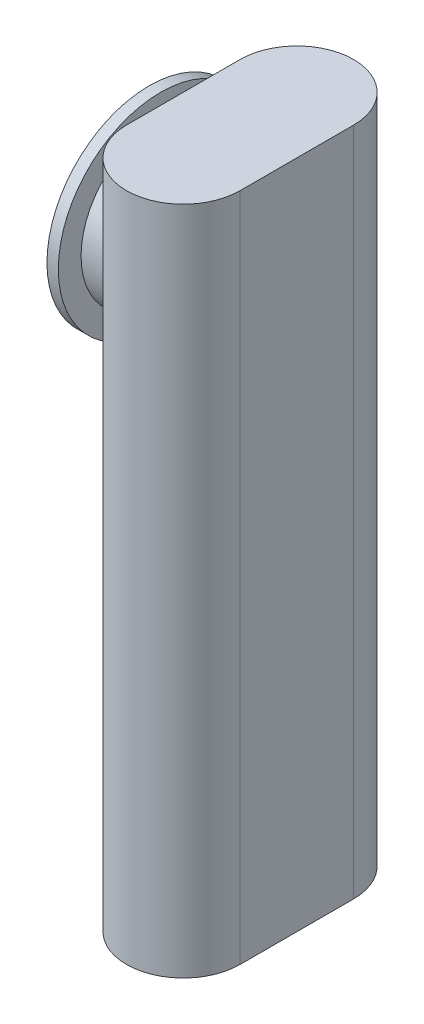
ISO-10303-21;
HEADER;
FILE_DESCRIPTION(('STEP AP214'),'2;1');
FILE_NAME('part.step','',(''),(''),'','','');
FILE_SCHEMA(('AUTOMOTIVE_DESIGN { 1 0 10303 214 1 1 1 1 }'));
ENDSEC;
DATA;
#1=APPLICATION_CONTEXT('core data for automotive mechanical design processes');
#2=APPLICATION_PROTOCOL_DEFINITION('international standard','automotive_design',2000,#1);
#3=PRODUCT_CONTEXT('',#1,'mechanical');
#4=PRODUCT('Part','Part','',(#3));
#5=PRODUCT_RELATED_PRODUCT_CATEGORY('part','',(#4));
#6=PRODUCT_DEFINITION_FORMATION('','',#4);
#7=PRODUCT_DEFINITION_CONTEXT('part definition',#1,'design');
#8=PRODUCT_DEFINITION('design','',#6,#7);
#9=PRODUCT_DEFINITION_SHAPE('','',#8);
#10=(LENGTH_UNIT() NAMED_UNIT(*) SI_UNIT(.MILLI.,.METRE.));
#11=(NAMED_UNIT(*) PLANE_ANGLE_UNIT() SI_UNIT($,.RADIAN.));
#12=(NAMED_UNIT(*) SI_UNIT($,.STERADIAN.) SOLID_ANGLE_UNIT());
#13=UNCERTAINTY_MEASURE_WITH_UNIT(LENGTH_MEASURE(1.E-05),#10,'distance_accuracy_value','');
#14=(GEOMETRIC_REPRESENTATION_CONTEXT(3) GLOBAL_UNCERTAINTY_ASSIGNED_CONTEXT((#13)) GLOBAL_UNIT_ASSIGNED_CONTEXT((#10,
#11,#12)) REPRESENTATION_CONTEXT('',''));
#15=CARTESIAN_POINT('',(0.,0.,0.));
#16=DIRECTION('',(0.,0.,1.));
#17=DIRECTION('',(1.,0.,0.));
#18=AXIS2_PLACEMENT_3D('',#15,#16,#17);
#19=CARTESIAN_POINT('',(-19.,23.,0.));
#20=DIRECTION('',(-1.,0.,0.));
#21=DIRECTION('',(0.,0.,1.));
#22=AXIS2_PLACEMENT_3D('',#19,#20,#21);
#23=CYLINDRICAL_SURFACE('',#22,2.5);
#24=CARTESIAN_POINT('',(-19.,23.,0.));
#25=DIRECTION('',(-1.,0.,0.));
#26=DIRECTION('',(0.,0.,1.));
#27=AXIS2_PLACEMENT_3D('',#24,#25,#26);
#28=CIRCLE('',#27,2.5);
#29=CARTESIAN_POINT('',(-19.,23.,2.5));
#30=VERTEX_POINT('',#29);
#31=EDGE_CURVE('E54',#30,#30,#28,.T.);
#32=ORIENTED_EDGE('',*,*,#31,.F.);
#33=EDGE_LOOP('',(#32));
#34=FACE_BOUND('',#33,.T.);
#35=CARTESIAN_POINT('',(-21.,23.,0.));
#36=DIRECTION('',(-1.,0.,0.));
#37=DIRECTION('',(0.,0.,1.));
#38=AXIS2_PLACEMENT_3D('',#35,#36,#37);
#39=CIRCLE('',#38,2.5);
#40=CARTESIAN_POINT('',(-21.,23.,2.5));
#41=VERTEX_POINT('',#40);
#42=EDGE_CURVE('E68',#41,#41,#39,.F.);
#43=ORIENTED_EDGE('',*,*,#42,.F.);
#44=EDGE_LOOP('',(#43));
#45=FACE_BOUND('',#44,.T.);
#46=ADVANCED_FACE('F48',(#34,#45),#23,.F.);
#47=CARTESIAN_POINT('',(-19.,23.,0.));
#48=DIRECTION('',(-1.,0.,0.));
#49=DIRECTION('',(0.,0.,1.));
#50=AXIS2_PLACEMENT_3D('',#47,#48,#49);
#51=CYLINDRICAL_SURFACE('',#50,3.5);
#52=CARTESIAN_POINT('',(-19.,23.,0.));
#53=DIRECTION('',(-1.,0.,0.));
#54=DIRECTION('',(0.,0.,1.));
#55=AXIS2_PLACEMENT_3D('',#52,#53,#54);
#56=CIRCLE('',#55,3.5);
#57=CARTESIAN_POINT('',(-19.,23.,3.5));
#58=VERTEX_POINT('',#57);
#59=EDGE_CURVE('E11',#58,#58,#56,.T.);
#60=ORIENTED_EDGE('',*,*,#59,.T.);
#61=EDGE_LOOP('',(#60));
#62=FACE_BOUND('',#61,.T.);
#63=CARTESIAN_POINT('',(-20.5,23.,0.));
#64=DIRECTION('',(-1.,0.,0.));
#65=DIRECTION('',(0.,0.,1.));
#66=AXIS2_PLACEMENT_3D('',#63,#64,#65);
#67=CIRCLE('',#66,3.5);
#68=CARTESIAN_POINT('',(-20.5,23.,3.5));
#69=VERTEX_POINT('',#68);
#70=EDGE_CURVE('E58',#69,#69,#67,.T.);
#71=ORIENTED_EDGE('',*,*,#70,.F.);
#72=EDGE_LOOP('',(#71));
#73=FACE_BOUND('',#72,.T.);
#74=ADVANCED_FACE('F78',(#62,#73),#51,.T.);
#75=CARTESIAN_POINT('',(-19.,0.,0.));
#76=DIRECTION('',(-1.,0.,0.));
#77=DIRECTION('',(0.,0.,1.));
#78=AXIS2_PLACEMENT_3D('',#75,#76,#77);
#79=PLANE('',#78);
#80=ORIENTED_EDGE('',*,*,#31,.T.);
#81=EDGE_LOOP('',(#80));
#82=FACE_BOUND('',#81,.T.);
#83=ORIENTED_EDGE('',*,*,#59,.F.);
#84=EDGE_LOOP('',(#83));
#85=FACE_BOUND('',#84,.T.);
#86=ADVANCED_FACE('F83',(#82,#85),#79,.F.);
#87=CARTESIAN_POINT('',(-21.,23.,0.));
#88=DIRECTION('',(1.,0.,0.));
#89=DIRECTION('',(0.,0.,-1.));
#90=AXIS2_PLACEMENT_3D('',#87,#88,#89);
#91=CYLINDRICAL_SURFACE('',#90,4.5);
#92=CARTESIAN_POINT('',(-21.,23.,0.));
#93=DIRECTION('',(-1.,0.,0.));
#94=DIRECTION('',(0.,0.,1.));
#95=AXIS2_PLACEMENT_3D('',#92,#93,#94);
#96=CIRCLE('',#95,4.5);
#97=CARTESIAN_POINT('',(-21.,23.,4.5));
#98=VERTEX_POINT('',#97);
#99=EDGE_CURVE('E62',#98,#98,#96,.T.);
#100=ORIENTED_EDGE('',*,*,#99,.F.);
#101=EDGE_LOOP('',(#100));
#102=FACE_BOUND('',#101,.T.);
#103=CARTESIAN_POINT('',(-20.5,23.,0.));
#104=DIRECTION('',(-1.,0.,0.));
#105=DIRECTION('',(0.,0.,1.));
#106=AXIS2_PLACEMENT_3D('',#103,#104,#105);
#107=CIRCLE('',#106,4.5);
#108=CARTESIAN_POINT('',(-20.5,23.,4.5));
#109=VERTEX_POINT('',#108);
#110=EDGE_CURVE('E65',#109,#109,#107,.T.);
#111=ORIENTED_EDGE('',*,*,#110,.T.);
#112=EDGE_LOOP('',(#111));
#113=FACE_BOUND('',#112,.T.);
#114=ADVANCED_FACE('F87',(#102,#113),#91,.T.);
#115=CARTESIAN_POINT('',(-21.,0.,0.));
#116=DIRECTION('',(-1.,0.,0.));
#117=DIRECTION('',(0.,0.,1.));
#118=AXIS2_PLACEMENT_3D('',#115,#116,#117);
#119=PLANE('',#118);
#120=ORIENTED_EDGE('',*,*,#42,.T.);
#121=EDGE_LOOP('',(#120));
#122=FACE_BOUND('',#121,.T.);
#123=ORIENTED_EDGE('',*,*,#99,.T.);
#124=EDGE_LOOP('',(#123));
#125=FACE_BOUND('',#124,.T.);
#126=ADVANCED_FACE('F74',(#122,#125),#119,.T.);
#127=CARTESIAN_POINT('',(-20.5,0.,0.));
#128=DIRECTION('',(-1.,0.,0.));
#129=DIRECTION('',(0.,0.,1.));
#130=AXIS2_PLACEMENT_3D('',#127,#128,#129);
#131=PLANE('',#130);
#132=ORIENTED_EDGE('',*,*,#70,.T.);
#133=EDGE_LOOP('',(#132));
#134=FACE_BOUND('',#133,.T.);
#135=ORIENTED_EDGE('',*,*,#110,.F.);
#136=EDGE_LOOP('',(#135));
#137=FACE_BOUND('',#136,.T.);
#138=ADVANCED_FACE('F94',(#134,#137),#131,.F.);
#139=CLOSED_SHELL('',(#46,#74,#86,#114,#126,#138));
#140=MANIFOLD_SOLID_BREP('B2',#139);
#141=CARTESIAN_POINT('',(-19.5,28.,0.));
#142=DIRECTION('',(-1.,0.,0.));
#143=DIRECTION('',(0.,0.,1.));
#144=AXIS2_PLACEMENT_3D('',#141,#142,#143);
#145=PLANE('',#144);
#146=CARTESIAN_POINT('',(-19.5,23.,0.));
#147=DIRECTION('',(-1.,0.,0.));
#148=DIRECTION('',(0.,0.,1.));
#149=AXIS2_PLACEMENT_3D('',#146,#147,#148);
#150=CIRCLE('',#149,2.5);
#151=CARTESIAN_POINT('',(-19.5,23.,2.5));
#152=VERTEX_POINT('',#151);
#153=CARTESIAN_POINT('',(-19.5,23.,-2.5));
#154=VERTEX_POINT('',#153);
#155=EDGE_CURVE('E190',#152,#154,#150,.T.);
#156=ORIENTED_EDGE('',*,*,#155,.F.);
#157=DIRECTION('',(0.,-1.,0.));
#158=VECTOR('',#157,1.);
#159=CARTESIAN_POINT('',(-19.5,28.,2.5));
#160=LINE('',#159,#158);
#161=CARTESIAN_POINT('',(-19.5,28.,2.5));
#162=VERTEX_POINT('',#161);
#163=EDGE_CURVE('E354',#162,#152,#160,.T.);
#164=ORIENTED_EDGE('',*,*,#163,.F.);
#165=DIRECTION('',(0.,0.,-1.));
#166=VECTOR('',#165,1.);
#167=CARTESIAN_POINT('',(-19.5,28.,0.));
#168=LINE('',#167,#166);
#169=CARTESIAN_POINT('',(-19.5,28.,-2.5));
#170=VERTEX_POINT('',#169);
#171=EDGE_CURVE('E323',#162,#170,#168,.T.);
#172=ORIENTED_EDGE('',*,*,#171,.T.);
#173=DIRECTION('',(0.,-1.,0.));
#174=VECTOR('',#173,1.);
#175=CARTESIAN_POINT('',(-19.5,28.,-2.5));
#176=LINE('',#175,#174);
#177=EDGE_CURVE('E344',#170,#154,#176,.T.);
#178=ORIENTED_EDGE('',*,*,#177,.T.);
#179=EDGE_LOOP('',(#156,#164,#172,#178));
#180=FACE_BOUND('',#179,.T.);
#181=ADVANCED_FACE('F166',(#180),#145,.T.);
#182=EDGE_CURVE('E291',#154,#152,#150,.T.);
#183=ORIENTED_EDGE('',*,*,#182,.F.);
#184=CARTESIAN_POINT('',(-19.5,-1.5,-2.5));
#185=VERTEX_POINT('',#184);
#186=EDGE_CURVE('E343',#154,#185,#176,.T.);
#187=ORIENTED_EDGE('',*,*,#186,.T.);
#188=DIRECTION('',(0.,0.,-1.));
#189=VECTOR('',#188,1.);
#190=CARTESIAN_POINT('',(-19.5,-1.5,0.));
#191=LINE('',#190,#189);
#192=CARTESIAN_POINT('',(-19.5,-1.5,2.5));
#193=VERTEX_POINT('',#192);
#194=EDGE_CURVE('E294',#193,#185,#191,.T.);
#195=ORIENTED_EDGE('',*,*,#194,.F.);
#196=EDGE_CURVE('E353',#152,#193,#160,.T.);
#197=ORIENTED_EDGE('',*,*,#196,.F.);
#198=EDGE_LOOP('',(#183,#187,#195,#197));
#199=FACE_BOUND('',#198,.T.);
#200=ADVANCED_FACE('F168',(#199),#145,.T.);
#201=CARTESIAN_POINT('',(-17.,28.,2.5));
#202=DIRECTION('',(0.,-1.,0.));
#203=DIRECTION('',(0.,0.,-1.));
#204=AXIS2_PLACEMENT_3D('',#201,#202,#203);
#205=CYLINDRICAL_SURFACE('',#204,2.5);
#206=ORIENTED_EDGE('',*,*,#163,.T.);
#207=ORIENTED_EDGE('',*,*,#196,.T.);
#208=CARTESIAN_POINT('',(-17.,-1.5,2.5));
#209=DIRECTION('',(0.,1.,0.));
#210=DIRECTION('',(0.,0.,1.));
#211=AXIS2_PLACEMENT_3D('',#208,#209,#210);
#212=CIRCLE('',#211,2.5);
#213=CARTESIAN_POINT('',(-14.5,-1.5,2.5));
#214=VERTEX_POINT('',#213);
#215=EDGE_CURVE('E298',#214,#193,#212,.F.);
#216=ORIENTED_EDGE('',*,*,#215,.F.);
#217=DIRECTION('',(0.,-1.,0.));
#218=VECTOR('',#217,1.);
#219=CARTESIAN_POINT('',(-14.5,28.,2.5));
#220=LINE('',#219,#218);
#221=CARTESIAN_POINT('',(-14.5,28.,2.5));
#222=VERTEX_POINT('',#221);
#223=EDGE_CURVE('E351',#222,#214,#220,.T.);
#224=ORIENTED_EDGE('',*,*,#223,.F.);
#225=CARTESIAN_POINT('',(-17.,28.,2.5));
#226=DIRECTION('',(0.,1.,0.));
#227=DIRECTION('',(0.,0.,1.));
#228=AXIS2_PLACEMENT_3D('',#225,#226,#227);
#229=CIRCLE('',#228,2.5);
#230=EDGE_CURVE('E332',#222,#162,#229,.F.);
#231=ORIENTED_EDGE('',*,*,#230,.T.);
#232=EDGE_LOOP('',(#206,#207,#216,#224,#231));
#233=FACE_BOUND('',#232,.T.);
#234=ADVANCED_FACE('F363',(#233),#205,.T.);
#235=CARTESIAN_POINT('',(-14.5,28.,0.));
#236=DIRECTION('',(1.,0.,0.));
#237=DIRECTION('',(0.,0.,-1.));
#238=AXIS2_PLACEMENT_3D('',#235,#236,#237);
#239=PLANE('',#238);
#240=ORIENTED_EDGE('',*,*,#223,.T.);
#241=DIRECTION('',(0.,0.,1.));
#242=VECTOR('',#241,1.);
#243=CARTESIAN_POINT('',(-14.5,-1.5,0.));
#244=LINE('',#243,#242);
#245=CARTESIAN_POINT('',(-14.5,-1.5,-2.5));
#246=VERTEX_POINT('',#245);
#247=EDGE_CURVE('E302',#246,#214,#244,.T.);
#248=ORIENTED_EDGE('',*,*,#247,.F.);
#249=DIRECTION('',(0.,-1.,0.));
#250=VECTOR('',#249,1.);
#251=CARTESIAN_POINT('',(-14.5,28.,-2.5));
#252=LINE('',#251,#250);
#253=CARTESIAN_POINT('',(-14.5,28.,-2.5));
#254=VERTEX_POINT('',#253);
#255=EDGE_CURVE('E348',#254,#246,#252,.T.);
#256=ORIENTED_EDGE('',*,*,#255,.F.);
#257=DIRECTION('',(0.,0.,1.));
#258=VECTOR('',#257,1.);
#259=CARTESIAN_POINT('',(-14.5,28.,0.));
#260=LINE('',#259,#258);
#261=EDGE_CURVE('E336',#254,#222,#260,.T.);
#262=ORIENTED_EDGE('',*,*,#261,.T.);
#263=EDGE_LOOP('',(#240,#248,#256,#262));
#264=FACE_BOUND('',#263,.T.);
#265=ADVANCED_FACE('F387',(#264),#239,.T.);
#266=CARTESIAN_POINT('',(-17.,28.,-2.49999999999999));
#267=DIRECTION('',(0.,-1.,0.));
#268=DIRECTION('',(0.,0.,-1.));
#269=AXIS2_PLACEMENT_3D('',#266,#267,#268);
#270=CYLINDRICAL_SURFACE('',#269,2.5);
#271=ORIENTED_EDGE('',*,*,#255,.T.);
#272=CARTESIAN_POINT('',(-17.,-1.5,-2.49999999999999));
#273=DIRECTION('',(0.,1.,0.));
#274=DIRECTION('',(0.,0.,1.));
#275=AXIS2_PLACEMENT_3D('',#272,#273,#274);
#276=CIRCLE('',#275,2.5);
#277=EDGE_CURVE('E306',#246,#185,#276,.T.);
#278=ORIENTED_EDGE('',*,*,#277,.T.);
#279=ORIENTED_EDGE('',*,*,#186,.F.);
#280=ORIENTED_EDGE('',*,*,#177,.F.);
#281=CARTESIAN_POINT('',(-17.,28.,-2.49999999999999));
#282=DIRECTION('',(0.,1.,0.));
#283=DIRECTION('',(0.,0.,1.));
#284=AXIS2_PLACEMENT_3D('',#281,#282,#283);
#285=CIRCLE('',#284,2.5);
#286=EDGE_CURVE('E340',#254,#170,#285,.T.);
#287=ORIENTED_EDGE('',*,*,#286,.F.);
#288=EDGE_LOOP('',(#271,#278,#279,#280,#287));
#289=FACE_BOUND('',#288,.T.);
#290=ADVANCED_FACE('F381',(#289),#270,.T.);
#291=CARTESIAN_POINT('',(0.,28.,0.));
#292=DIRECTION('',(0.,1.,0.));
#293=DIRECTION('',(0.,0.,1.));
#294=AXIS2_PLACEMENT_3D('',#291,#292,#293);
#295=PLANE('',#294);
#296=ORIENTED_EDGE('',*,*,#171,.F.);
#297=ORIENTED_EDGE('',*,*,#230,.F.);
#298=ORIENTED_EDGE('',*,*,#261,.F.);
#299=ORIENTED_EDGE('',*,*,#286,.T.);
#300=EDGE_LOOP('',(#296,#297,#298,#299));
#301=FACE_BOUND('',#300,.T.);
#302=ADVANCED_FACE('F385',(#301),#295,.T.);
#303=CARTESIAN_POINT('',(-17.,-1.5,2.5));
#304=DIRECTION('',(0.,1.,0.));
#305=DIRECTION('',(0.,0.,1.));
#306=AXIS2_PLACEMENT_3D('',#303,#304,#305);
#307=CYLINDRICAL_SURFACE('',#306,2.);
#308=DIRECTION('',(0.,1.,0.));
#309=VECTOR('',#308,1.);
#310=CARTESIAN_POINT('',(-19.,-1.5,2.5));
#311=LINE('',#310,#309);
#312=CARTESIAN_POINT('',(-19.,-1.5,2.5));
#313=VERTEX_POINT('',#312);
#314=CARTESIAN_POINT('',(-19.,23.,2.5));
#315=VERTEX_POINT('',#314);
#316=EDGE_CURVE('E183',#313,#315,#311,.T.);
#317=ORIENTED_EDGE('',*,*,#316,.T.);
#318=DIRECTION('',(0.,-1.,0.));
#319=VECTOR('',#318,1.);
#320=CARTESIAN_POINT('',(-19.,25.5,2.5));
#321=LINE('',#320,#319);
#322=CARTESIAN_POINT('',(-19.,25.5,2.5));
#323=VERTEX_POINT('',#322);
#324=EDGE_CURVE('E285',#323,#315,#321,.T.);
#325=ORIENTED_EDGE('',*,*,#324,.F.);
#326=CARTESIAN_POINT('',(-17.,25.5,2.5));
#327=DIRECTION('',(0.,1.,0.));
#328=DIRECTION('',(0.,0.,1.));
#329=AXIS2_PLACEMENT_3D('',#326,#327,#328);
#330=CIRCLE('',#329,2.);
#331=CARTESIAN_POINT('',(-15.,25.5,2.5));
#332=VERTEX_POINT('',#331);
#333=EDGE_CURVE('E282',#332,#323,#330,.F.);
#334=ORIENTED_EDGE('',*,*,#333,.F.);
#335=DIRECTION('',(0.,1.,0.));
#336=VECTOR('',#335,1.);
#337=CARTESIAN_POINT('',(-15.,-1.5,2.5));
#338=LINE('',#337,#336);
#339=CARTESIAN_POINT('',(-15.,-1.5,2.5));
#340=VERTEX_POINT('',#339);
#341=EDGE_CURVE('E261',#340,#332,#338,.T.);
#342=ORIENTED_EDGE('',*,*,#341,.F.);
#343=CARTESIAN_POINT('',(-17.,-1.5,2.5));
#344=DIRECTION('',(0.,1.,0.));
#345=DIRECTION('',(0.,0.,1.));
#346=AXIS2_PLACEMENT_3D('',#343,#344,#345);
#347=CIRCLE('',#346,2.);
#348=EDGE_CURVE('E310',#340,#313,#347,.F.);
#349=ORIENTED_EDGE('',*,*,#348,.T.);
#350=EDGE_LOOP('',(#317,#325,#334,#342,#349));
#351=FACE_BOUND('',#350,.T.);
#352=ADVANCED_FACE('F421',(#351),#307,.F.);
#353=CARTESIAN_POINT('',(-15.,-1.5,0.));
#354=DIRECTION('',(-1.,0.,0.));
#355=DIRECTION('',(0.,0.,1.));
#356=AXIS2_PLACEMENT_3D('',#353,#354,#355);
#357=PLANE('',#356);
#358=ORIENTED_EDGE('',*,*,#341,.T.);
#359=DIRECTION('',(0.,0.,1.));
#360=VECTOR('',#359,1.);
#361=CARTESIAN_POINT('',(-15.,25.5,0.));
#362=LINE('',#361,#360);
#363=CARTESIAN_POINT('',(-15.,25.5,-2.49999999999999));
#364=VERTEX_POINT('',#363);
#365=EDGE_CURVE('E268',#364,#332,#362,.T.);
#366=ORIENTED_EDGE('',*,*,#365,.F.);
#367=DIRECTION('',(0.,1.,0.));
#368=VECTOR('',#367,1.);
#369=CARTESIAN_POINT('',(-15.,-1.5,-2.49999999999999));
#370=LINE('',#369,#368);
#371=CARTESIAN_POINT('',(-15.,-1.5,-2.49999999999999));
#372=VERTEX_POINT('',#371);
#373=EDGE_CURVE('E248',#372,#364,#370,.T.);
#374=ORIENTED_EDGE('',*,*,#373,.F.);
#375=DIRECTION('',(0.,0.,1.));
#376=VECTOR('',#375,1.);
#377=CARTESIAN_POINT('',(-15.,-1.5,0.));
#378=LINE('',#377,#376);
#379=EDGE_CURVE('E319',#372,#340,#378,.T.);
#380=ORIENTED_EDGE('',*,*,#379,.T.);
#381=EDGE_LOOP('',(#358,#366,#374,#380));
#382=FACE_BOUND('',#381,.T.);
#383=ADVANCED_FACE('F275',(#382),#357,.T.);
#384=CARTESIAN_POINT('',(-17.,-1.5,-2.49999999999999));
#385=DIRECTION('',(0.,1.,0.));
#386=DIRECTION('',(0.,0.,1.));
#387=AXIS2_PLACEMENT_3D('',#384,#385,#386);
#388=CYLINDRICAL_SURFACE('',#387,2.00000000000001);
#389=ORIENTED_EDGE('',*,*,#373,.T.);
#390=CARTESIAN_POINT('',(-17.,25.5,-2.49999999999999));
#391=DIRECTION('',(0.,1.,0.));
#392=DIRECTION('',(0.,0.,1.));
#393=AXIS2_PLACEMENT_3D('',#390,#391,#392);
#394=CIRCLE('',#393,2.00000000000001);
#395=CARTESIAN_POINT('',(-19.,25.5,-2.5));
#396=VERTEX_POINT('',#395);
#397=EDGE_CURVE('E252',#364,#396,#394,.T.);
#398=ORIENTED_EDGE('',*,*,#397,.T.);
#399=DIRECTION('',(0.,-1.,0.));
#400=VECTOR('',#399,1.);
#401=CARTESIAN_POINT('',(-19.,25.5,-2.5));
#402=LINE('',#401,#400);
#403=CARTESIAN_POINT('',(-19.,23.,-2.5));
#404=VERTEX_POINT('',#403);
#405=EDGE_CURVE('E288',#396,#404,#402,.T.);
#406=ORIENTED_EDGE('',*,*,#405,.T.);
#407=DIRECTION('',(0.,1.,0.));
#408=VECTOR('',#407,1.);
#409=CARTESIAN_POINT('',(-19.,-1.5,-2.5));
#410=LINE('',#409,#408);
#411=CARTESIAN_POINT('',(-19.,-1.5,-2.5));
#412=VERTEX_POINT('',#411);
#413=EDGE_CURVE('E262',#412,#404,#410,.T.);
#414=ORIENTED_EDGE('',*,*,#413,.F.);
#415=CARTESIAN_POINT('',(-17.,-1.5,-2.49999999999999));
#416=DIRECTION('',(0.,1.,0.));
#417=DIRECTION('',(0.,0.,1.));
#418=AXIS2_PLACEMENT_3D('',#415,#416,#417);
#419=CIRCLE('',#418,2.00000000000001);
#420=EDGE_CURVE('E255',#372,#412,#419,.T.);
#421=ORIENTED_EDGE('',*,*,#420,.F.);
#422=EDGE_LOOP('',(#389,#398,#406,#414,#421));
#423=FACE_BOUND('',#422,.T.);
#424=ADVANCED_FACE('F250',(#423),#388,.F.);
#425=CARTESIAN_POINT('',(-19.,-1.5,0.));
#426=DIRECTION('',(1.,0.,0.));
#427=DIRECTION('',(0.,0.,-1.));
#428=AXIS2_PLACEMENT_3D('',#425,#426,#427);
#429=PLANE('',#428);
#430=ORIENTED_EDGE('',*,*,#413,.T.);
#431=CARTESIAN_POINT('',(-19.,23.,0.));
#432=DIRECTION('',(-1.,0.,0.));
#433=DIRECTION('',(0.,0.,1.));
#434=AXIS2_PLACEMENT_3D('',#431,#432,#433);
#435=CIRCLE('',#434,2.5);
#436=EDGE_CURVE('E176',#315,#404,#435,.F.);
#437=ORIENTED_EDGE('',*,*,#436,.F.);
#438=ORIENTED_EDGE('',*,*,#316,.F.);
#439=DIRECTION('',(0.,0.,-1.));
#440=VECTOR('',#439,1.);
#441=CARTESIAN_POINT('',(-19.,-1.5,0.));
#442=LINE('',#441,#440);
#443=EDGE_CURVE('E313',#313,#412,#442,.T.);
#444=ORIENTED_EDGE('',*,*,#443,.T.);
#445=EDGE_LOOP('',(#430,#437,#438,#444));
#446=FACE_BOUND('',#445,.T.);
#447=ADVANCED_FACE('F444',(#446),#429,.T.);
#448=CARTESIAN_POINT('',(0.,-1.5,0.));
#449=DIRECTION('',(0.,1.,0.));
#450=DIRECTION('',(0.,0.,1.));
#451=AXIS2_PLACEMENT_3D('',#448,#449,#450);
#452=PLANE('',#451);
#453=ORIENTED_EDGE('',*,*,#194,.T.);
#454=ORIENTED_EDGE('',*,*,#277,.F.);
#455=ORIENTED_EDGE('',*,*,#247,.T.);
#456=ORIENTED_EDGE('',*,*,#215,.T.);
#457=EDGE_LOOP('',(#453,#454,#455,#456));
#458=FACE_BOUND('',#457,.T.);
#459=ORIENTED_EDGE('',*,*,#348,.F.);
#460=ORIENTED_EDGE('',*,*,#379,.F.);
#461=ORIENTED_EDGE('',*,*,#420,.T.);
#462=ORIENTED_EDGE('',*,*,#443,.F.);
#463=EDGE_LOOP('',(#459,#460,#461,#462));
#464=FACE_BOUND('',#463,.T.);
#465=ADVANCED_FACE('F367',(#458,#464),#452,.F.);
#466=CARTESIAN_POINT('',(-17.75,23.,0.));
#467=DIRECTION('',(-1.,0.,0.));
#468=DIRECTION('',(0.,0.,1.));
#469=AXIS2_PLACEMENT_3D('',#466,#467,#468);
#470=CYLINDRICAL_SURFACE('',#469,2.5);
#471=ORIENTED_EDGE('',*,*,#436,.T.);
#472=CARTESIAN_POINT('',(-19.,25.5,0.));
#473=VERTEX_POINT('',#472);
#474=EDGE_CURVE('E46',#404,#473,#435,.F.);
#475=ORIENTED_EDGE('',*,*,#474,.T.);
#476=EDGE_CURVE('E170',#473,#315,#435,.F.);
#477=ORIENTED_EDGE('',*,*,#476,.T.);
#478=EDGE_LOOP('',(#471,#475,#477));
#479=FACE_BOUND('',#478,.T.);
#480=ORIENTED_EDGE('',*,*,#155,.T.);
#481=ORIENTED_EDGE('',*,*,#182,.T.);
#482=EDGE_LOOP('',(#480,#481));
#483=FACE_BOUND('',#482,.T.);
#484=ADVANCED_FACE('F377',(#479,#483),#470,.F.);
#485=CARTESIAN_POINT('',(-19.,25.5,0.));
#486=DIRECTION('',(-1.,0.,0.));
#487=DIRECTION('',(0.,0.,1.));
#488=AXIS2_PLACEMENT_3D('',#485,#486,#487);
#489=PLANE('',#488);
#490=ORIENTED_EDGE('',*,*,#405,.F.);
#491=DIRECTION('',(0.,0.,-1.));
#492=VECTOR('',#491,1.);
#493=CARTESIAN_POINT('',(-19.,25.5,0.));
#494=LINE('',#493,#492);
#495=EDGE_CURVE('E272',#473,#396,#494,.T.);
#496=ORIENTED_EDGE('',*,*,#495,.F.);
#497=ORIENTED_EDGE('',*,*,#474,.F.);
#498=EDGE_LOOP('',(#490,#496,#497));
#499=FACE_BOUND('',#498,.T.);
#500=ADVANCED_FACE('F465',(#499),#489,.F.);
#501=EDGE_CURVE('E279',#323,#473,#494,.T.);
#502=ORIENTED_EDGE('',*,*,#501,.F.);
#503=ORIENTED_EDGE('',*,*,#324,.T.);
#504=ORIENTED_EDGE('',*,*,#476,.F.);
#505=EDGE_LOOP('',(#502,#503,#504));
#506=FACE_BOUND('',#505,.T.);
#507=ADVANCED_FACE('F475',(#506),#489,.F.);
#508=CARTESIAN_POINT('',(0.,25.5,0.));
#509=DIRECTION('',(0.,1.,0.));
#510=DIRECTION('',(0.,0.,1.));
#511=AXIS2_PLACEMENT_3D('',#508,#509,#510);
#512=PLANE('',#511);
#513=ORIENTED_EDGE('',*,*,#365,.T.);
#514=ORIENTED_EDGE('',*,*,#333,.T.);
#515=ORIENTED_EDGE('',*,*,#501,.T.);
#516=ORIENTED_EDGE('',*,*,#495,.T.);
#517=ORIENTED_EDGE('',*,*,#397,.F.);
#518=EDGE_LOOP('',(#513,#514,#515,#516,#517));
#519=FACE_BOUND('',#518,.T.);
#520=ADVANCED_FACE('F266',(#519),#512,.F.);
#521=CLOSED_SHELL('',(#181,#200,#234,#265,#290,#302,#352,#383,#424,#447,#465,#484,#500,#507,#520));
#522=MANIFOLD_SOLID_BREP('B6',#521);
#523=ADVANCED_BREP_SHAPE_REPRESENTATION('',(#18,#140,#522),#14);
#524=SHAPE_DEFINITION_REPRESENTATION(#9,#523);
ENDSEC;
END-ISO-10303-21;
